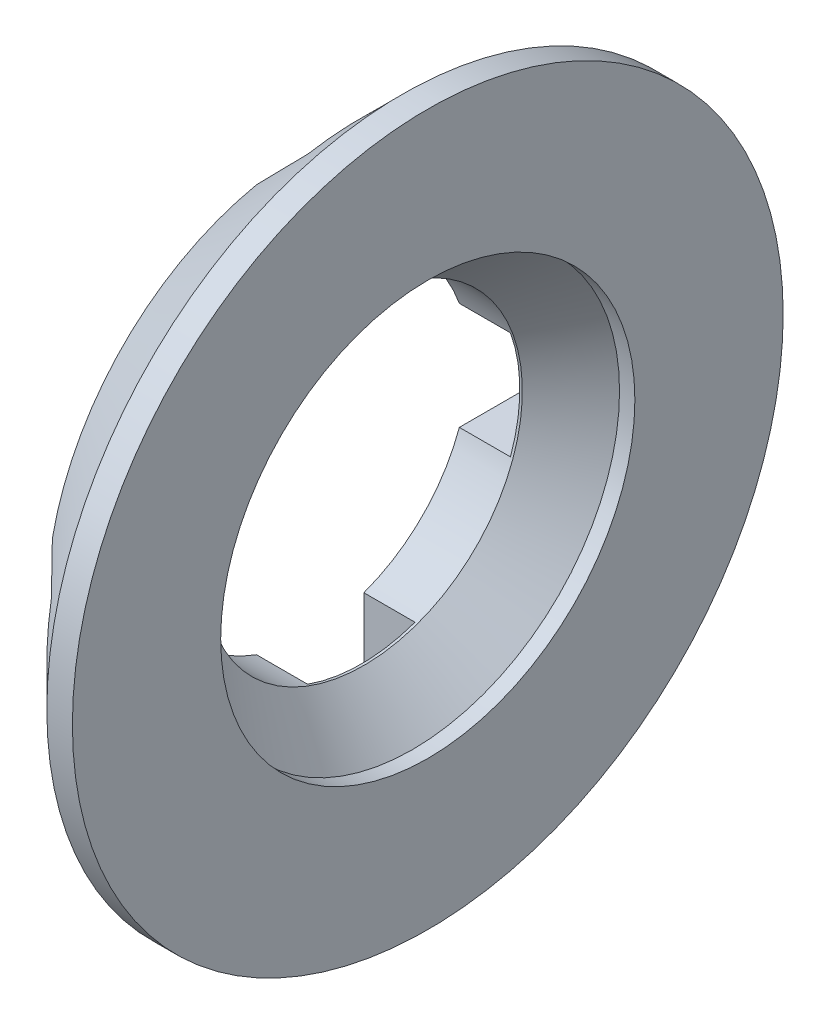
ISO-10303-21;
HEADER;
FILE_DESCRIPTION(('STEP AP214'),'2;1');
FILE_NAME('part.step','',(''),(''),'','','');
FILE_SCHEMA(('AUTOMOTIVE_DESIGN { 1 0 10303 214 1 1 1 1 }'));
ENDSEC;
DATA;
#1=APPLICATION_CONTEXT('core data for automotive mechanical design processes');
#2=APPLICATION_PROTOCOL_DEFINITION('international standard','automotive_design',2000,#1);
#3=PRODUCT_CONTEXT('',#1,'mechanical');
#4=PRODUCT('Part','Part','',(#3));
#5=PRODUCT_RELATED_PRODUCT_CATEGORY('part','',(#4));
#6=PRODUCT_DEFINITION_FORMATION('','',#4);
#7=PRODUCT_DEFINITION_CONTEXT('part definition',#1,'design');
#8=PRODUCT_DEFINITION('design','',#6,#7);
#9=PRODUCT_DEFINITION_SHAPE('','',#8);
#10=(LENGTH_UNIT() NAMED_UNIT(*) SI_UNIT(.MILLI.,.METRE.));
#11=(NAMED_UNIT(*) PLANE_ANGLE_UNIT() SI_UNIT($,.RADIAN.));
#12=(NAMED_UNIT(*) SI_UNIT($,.STERADIAN.) SOLID_ANGLE_UNIT());
#13=UNCERTAINTY_MEASURE_WITH_UNIT(LENGTH_MEASURE(1.E-05),#10,'distance_accuracy_value','');
#14=(GEOMETRIC_REPRESENTATION_CONTEXT(3) GLOBAL_UNCERTAINTY_ASSIGNED_CONTEXT((#13)) GLOBAL_UNIT_ASSIGNED_CONTEXT((#10,
#11,#12)) REPRESENTATION_CONTEXT('',''));
#15=CARTESIAN_POINT('',(0.,0.,0.));
#16=DIRECTION('',(0.,0.,1.));
#17=DIRECTION('',(1.,0.,0.));
#18=AXIS2_PLACEMENT_3D('',#15,#16,#17);
#19=CARTESIAN_POINT('',(8.43297067855262,15.,1.05));
#20=DIRECTION('',(0.,0.,1.));
#21=DIRECTION('',(0.,-1.,0.));
#22=AXIS2_PLACEMENT_3D('',#19,#20,#21);
#23=PLANE('',#22);
#24=CARTESIAN_POINT('',(8.43297067857819,21.0597029630019,1.05));
#25=CARTESIAN_POINT('',(8.2660332643413,20.8903226578739,1.05));
#26=CARTESIAN_POINT('',(8.09923122857827,20.7208093520447,1.05));
#27=CARTESIAN_POINT('',(7.76589789521229,20.3815167198608,1.05));
#28=CARTESIAN_POINT('',(7.59936659763985,20.2117373934761,1.05));
#29=CARTESIAN_POINT('',(7.43297067857179,20.0418250663602,1.05));
#30=B_SPLINE_CURVE_WITH_KNOTS('',3,(#24,#25,#26,#27,#28,#29),.UNSPECIFIED.,.F.,.F.,(4,2,4),(0.,
0.713455758887882,1.4269115982006),.UNSPECIFIED.);
#31=CARTESIAN_POINT('',(8.43297067858806,21.0597029630119,1.05));
#32=VERTEX_POINT('',#31);
#33=CARTESIAN_POINT('',(7.43297067856827,20.0418250663566,1.05));
#34=VERTEX_POINT('',#33);
#35=EDGE_CURVE('E21',#32,#34,#30,.T.);
#36=ORIENTED_EDGE('',*,*,#35,.F.);
#37=DIRECTION('',(0.,1.,0.));
#38=VECTOR('',#37,1.);
#39=CARTESIAN_POINT('',(8.43297067855262,15.,1.05));
#40=LINE('',#39,#38);
#41=CARTESIAN_POINT('',(8.43297067855262,17.916761903207,1.05));
#42=VERTEX_POINT('',#41);
#43=EDGE_CURVE('E176',#42,#32,#40,.T.);
#44=ORIENTED_EDGE('',*,*,#43,.F.);
#45=DIRECTION('',(1.,0.,0.));
#46=VECTOR('',#45,1.);
#47=CARTESIAN_POINT('',(8.43297067855262,17.916761903207,1.05));
#48=LINE('',#47,#46);
#49=CARTESIAN_POINT('',(7.43297067855262,17.916761903207,1.05));
#50=VERTEX_POINT('',#49);
#51=EDGE_CURVE('E274',#50,#42,#48,.T.);
#52=ORIENTED_EDGE('',*,*,#51,.F.);
#53=DIRECTION('',(0.,1.,0.));
#54=VECTOR('',#53,1.);
#55=CARTESIAN_POINT('',(7.43297067855262,15.,1.05));
#56=LINE('',#55,#54);
#57=EDGE_CURVE('E309',#34,#50,#56,.F.);
#58=ORIENTED_EDGE('',*,*,#57,.F.);
#59=EDGE_LOOP('',(#36,#44,#52,#58));
#60=FACE_BOUND('',#59,.T.);
#61=ADVANCED_FACE('F17',(#60),#23,.F.);
#62=CARTESIAN_POINT('',(8.43297067855262,16.05,0.));
#63=DIRECTION('',(0.,1.,0.));
#64=DIRECTION('',(0.,0.,1.));
#65=AXIS2_PLACEMENT_3D('',#62,#63,#64);
#66=PLANE('',#65);
#67=DIRECTION('',(1.,0.,0.));
#68=VECTOR('',#67,1.);
#69=CARTESIAN_POINT('',(8.43297067855262,16.05,2.91676190320705));
#70=LINE('',#69,#68);
#71=CARTESIAN_POINT('',(8.43297067855262,16.05,2.91676190320705));
#72=VERTEX_POINT('',#71);
#73=CARTESIAN_POINT('',(7.43297067855262,16.05,2.91676190320705));
#74=VERTEX_POINT('',#73);
#75=EDGE_CURVE('E228',#72,#74,#70,.F.);
#76=ORIENTED_EDGE('',*,*,#75,.F.);
#77=DIRECTION('',(0.,0.,1.));
#78=VECTOR('',#77,1.);
#79=CARTESIAN_POINT('',(8.43297067855262,16.05,1.05));
#80=LINE('',#79,#78);
#81=CARTESIAN_POINT('',(8.43297067858806,16.05,6.05970296301193));
#82=VERTEX_POINT('',#81);
#83=EDGE_CURVE('E307',#82,#72,#80,.F.);
#84=ORIENTED_EDGE('',*,*,#83,.F.);
#85=CARTESIAN_POINT('',(7.43297067857179,16.05,5.04182506636024));
#86=CARTESIAN_POINT('',(7.59936659763985,16.05,5.21173739347607));
#87=CARTESIAN_POINT('',(7.76589789521229,16.05,5.38151671986084));
#88=CARTESIAN_POINT('',(8.09923122857827,16.05,5.72080935204474));
#89=CARTESIAN_POINT('',(8.2660332643413,16.05,5.89032265787386));
#90=CARTESIAN_POINT('',(8.43297067857819,16.05,6.05970296300191));
#91=B_SPLINE_CURVE_WITH_KNOTS('',3,(#85,#86,#87,#88,#89,#90),.UNSPECIFIED.,.F.,.F.,(4,2,4),(0.,
0.713455839312713,1.4269115982006),.UNSPECIFIED.);
#92=CARTESIAN_POINT('',(7.43297067856827,16.05,5.04182506635664));
#93=VERTEX_POINT('',#92);
#94=EDGE_CURVE('E224',#93,#82,#91,.T.);
#95=ORIENTED_EDGE('',*,*,#94,.F.);
#96=DIRECTION('',(0.,0.,1.));
#97=VECTOR('',#96,1.);
#98=CARTESIAN_POINT('',(7.43297067855262,16.05,0.));
#99=LINE('',#98,#97);
#100=EDGE_CURVE('E175',#74,#93,#99,.T.);
#101=ORIENTED_EDGE('',*,*,#100,.F.);
#102=EDGE_LOOP('',(#76,#84,#95,#101));
#103=FACE_BOUND('',#102,.T.);
#104=ADVANCED_FACE('F229',(#103),#66,.F.);
#105=CARTESIAN_POINT('',(8.43297067855262,15.,1.05));
#106=DIRECTION('',(0.,0.,1.));
#107=DIRECTION('',(0.,-1.,0.));
#108=AXIS2_PLACEMENT_3D('',#105,#106,#107);
#109=PLANE('',#108);
#110=DIRECTION('',(1.,0.,0.));
#111=VECTOR('',#110,1.);
#112=CARTESIAN_POINT('',(8.43297067855262,12.083238096793,1.05000000000002));
#113=LINE('',#112,#111);
#114=CARTESIAN_POINT('',(8.43297067855262,12.083238096793,1.05000000000003));
#115=VERTEX_POINT('',#114);
#116=CARTESIAN_POINT('',(7.43297067855262,12.083238096793,1.05000000000002));
#117=VERTEX_POINT('',#116);
#118=EDGE_CURVE('E269',#115,#117,#113,.F.);
#119=ORIENTED_EDGE('',*,*,#118,.F.);
#120=DIRECTION('',(0.,1.,0.));
#121=VECTOR('',#120,1.);
#122=CARTESIAN_POINT('',(8.43297067855262,15.,1.05000000000004));
#123=LINE('',#122,#121);
#124=CARTESIAN_POINT('',(8.43297067858806,8.94029703698808,1.05000000000004));
#125=VERTEX_POINT('',#124);
#126=EDGE_CURVE('E117',#125,#115,#123,.T.);
#127=ORIENTED_EDGE('',*,*,#126,.F.);
#128=CARTESIAN_POINT('',(7.43297067857179,9.95817493363977,1.05000000000004));
#129=CARTESIAN_POINT('',(7.59936659763985,9.78826260652394,1.05000000000004));
#130=CARTESIAN_POINT('',(7.76589789521229,9.61848328013917,1.05000000000004));
#131=CARTESIAN_POINT('',(8.09923122857827,9.27919064795527,1.05000000000004));
#132=CARTESIAN_POINT('',(8.2660332643413,9.10967734212615,1.05000000000004));
#133=CARTESIAN_POINT('',(8.43297067857819,8.9402970369981,1.05000000000004));
#134=B_SPLINE_CURVE_WITH_KNOTS('',3,(#128,#129,#130,#131,#132,#133),.UNSPECIFIED.,.F.,.F.,(4,2,
4),(0.,0.713455839312713,1.4269115982006),.UNSPECIFIED.);
#135=CARTESIAN_POINT('',(7.43297067856827,9.95817493364336,1.05000000000003));
#136=VERTEX_POINT('',#135);
#137=EDGE_CURVE('E217',#136,#125,#134,.T.);
#138=ORIENTED_EDGE('',*,*,#137,.F.);
#139=DIRECTION('',(0.,1.,0.));
#140=VECTOR('',#139,1.);
#141=CARTESIAN_POINT('',(7.43297067855262,15.,1.05000000000002));
#142=LINE('',#141,#140);
#143=EDGE_CURVE('E302',#117,#136,#142,.F.);
#144=ORIENTED_EDGE('',*,*,#143,.F.);
#145=EDGE_LOOP('',(#119,#127,#138,#144));
#146=FACE_BOUND('',#145,.T.);
#147=ADVANCED_FACE('F232',(#146),#109,.F.);
#148=CARTESIAN_POINT('',(8.43297067855262,13.95,0.));
#149=DIRECTION('',(0.,-1.,0.));
#150=DIRECTION('',(0.,0.,-1.));
#151=AXIS2_PLACEMENT_3D('',#148,#149,#150);
#152=PLANE('',#151);
#153=CARTESIAN_POINT('',(8.43297067857819,13.9500000000001,6.05970296300192));
#154=CARTESIAN_POINT('',(8.2660332643413,13.9500000000001,5.89032265787387));
#155=CARTESIAN_POINT('',(8.09923122857827,13.9500000000001,5.72080935204475));
#156=CARTESIAN_POINT('',(7.76589789521229,13.9500000000001,5.38151671986085));
#157=CARTESIAN_POINT('',(7.59936659763985,13.9500000000001,5.21173739347608));
#158=CARTESIAN_POINT('',(7.43297067857179,13.9500000000001,5.04182506636026));
#159=B_SPLINE_CURVE_WITH_KNOTS('',3,(#153,#154,#155,#156,#157,#158),.UNSPECIFIED.,.F.,.F.,(4,2,
4),(0.,0.713455758887881,1.42691159820059),.UNSPECIFIED.);
#160=CARTESIAN_POINT('',(8.43297067858806,13.95,6.05970296301194));
#161=VERTEX_POINT('',#160);
#162=CARTESIAN_POINT('',(7.43297067856827,13.9500000000001,5.04182506635666));
#163=VERTEX_POINT('',#162);
#164=EDGE_CURVE('E210',#161,#163,#159,.T.);
#165=ORIENTED_EDGE('',*,*,#164,.F.);
#166=DIRECTION('',(0.,0.,1.));
#167=VECTOR('',#166,1.);
#168=CARTESIAN_POINT('',(8.43297067855262,13.95,1.05));
#169=LINE('',#168,#167);
#170=CARTESIAN_POINT('',(8.43297067855262,13.95,2.91676190320706));
#171=VERTEX_POINT('',#170);
#172=EDGE_CURVE('E305',#171,#161,#169,.T.);
#173=ORIENTED_EDGE('',*,*,#172,.F.);
#174=DIRECTION('',(1.,0.,0.));
#175=VECTOR('',#174,1.);
#176=CARTESIAN_POINT('',(8.43297067855262,13.95,2.91676190320706));
#177=LINE('',#176,#175);
#178=CARTESIAN_POINT('',(7.43297067855262,13.95,2.91676190320707));
#179=VERTEX_POINT('',#178);
#180=EDGE_CURVE('E264',#179,#171,#177,.T.);
#181=ORIENTED_EDGE('',*,*,#180,.F.);
#182=DIRECTION('',(0.,0.,1.));
#183=VECTOR('',#182,1.);
#184=CARTESIAN_POINT('',(7.43297067855262,13.9500000000001,0.));
#185=LINE('',#184,#183);
#186=EDGE_CURVE('E299',#163,#179,#185,.F.);
#187=ORIENTED_EDGE('',*,*,#186,.F.);
#188=EDGE_LOOP('',(#165,#173,#181,#187));
#189=FACE_BOUND('',#188,.T.);
#190=ADVANCED_FACE('F236',(#189),#152,.F.);
#191=CARTESIAN_POINT('',(8.43297067855262,15.,-1.05));
#192=DIRECTION('',(0.,0.,-1.));
#193=DIRECTION('',(-1.,0.,0.));
#194=AXIS2_PLACEMENT_3D('',#191,#192,#193);
#195=PLANE('',#194);
#196=CARTESIAN_POINT('',(8.43297067857819,8.94029703699809,-1.05));
#197=CARTESIAN_POINT('',(8.26603326434131,9.10967734212614,-1.05));
#198=CARTESIAN_POINT('',(8.09923122857827,9.27919064795526,-1.05));
#199=CARTESIAN_POINT('',(7.76589789521229,9.61848328013916,-1.05));
#200=CARTESIAN_POINT('',(7.59936659763986,9.78826260652393,-1.05));
#201=CARTESIAN_POINT('',(7.43297067857179,9.95817493363976,-1.05));
#202=B_SPLINE_CURVE_WITH_KNOTS('',3,(#196,#197,#198,#199,#200,#201),.UNSPECIFIED.,.F.,.F.,(4,2,
4),(0.,0.713455758887881,1.4269115982006),.UNSPECIFIED.);
#203=CARTESIAN_POINT('',(8.43297067858806,8.94029703698807,-1.04999999999999));
#204=VERTEX_POINT('',#203);
#205=CARTESIAN_POINT('',(7.43297067856827,9.95817493364335,-1.04999999999998));
#206=VERTEX_POINT('',#205);
#207=EDGE_CURVE('E248',#204,#206,#202,.T.);
#208=ORIENTED_EDGE('',*,*,#207,.F.);
#209=DIRECTION('',(0.,1.,0.));
#210=VECTOR('',#209,1.);
#211=CARTESIAN_POINT('',(8.43297067855262,15.,-1.04999999999998));
#212=LINE('',#211,#210);
#213=CARTESIAN_POINT('',(8.43297067855262,12.0832380967929,-1.04999999999999));
#214=VERTEX_POINT('',#213);
#215=EDGE_CURVE('E179',#214,#204,#212,.F.);
#216=ORIENTED_EDGE('',*,*,#215,.F.);
#217=DIRECTION('',(-1.,0.,0.));
#218=VECTOR('',#217,1.);
#219=CARTESIAN_POINT('',(8.43297067855262,12.0832380967929,-1.05));
#220=LINE('',#219,#218);
#221=CARTESIAN_POINT('',(7.43297067855262,12.0832380967929,-1.04999999999998));
#222=VERTEX_POINT('',#221);
#223=EDGE_CURVE('E252',#222,#214,#220,.F.);
#224=ORIENTED_EDGE('',*,*,#223,.F.);
#225=DIRECTION('',(0.,1.,0.));
#226=VECTOR('',#225,1.);
#227=CARTESIAN_POINT('',(7.43297067855262,15.,-1.04999999999996));
#228=LINE('',#227,#226);
#229=EDGE_CURVE('E293',#206,#222,#228,.T.);
#230=ORIENTED_EDGE('',*,*,#229,.F.);
#231=EDGE_LOOP('',(#208,#216,#224,#230));
#232=FACE_BOUND('',#231,.T.);
#233=ADVANCED_FACE('F241',(#232),#195,.F.);
#234=CARTESIAN_POINT('',(8.43297067855262,13.95,0.));
#235=DIRECTION('',(0.,-1.,0.));
#236=DIRECTION('',(0.,0.,-1.));
#237=AXIS2_PLACEMENT_3D('',#234,#235,#236);
#238=PLANE('',#237);
#239=DIRECTION('',(1.,0.,0.));
#240=VECTOR('',#239,1.);
#241=CARTESIAN_POINT('',(8.43297067855262,13.95,-2.91676190320704));
#242=LINE('',#241,#240);
#243=CARTESIAN_POINT('',(8.43297067855262,13.95,-2.91676190320704));
#244=VERTEX_POINT('',#243);
#245=CARTESIAN_POINT('',(7.43297067855262,13.95,-2.91676190320704));
#246=VERTEX_POINT('',#245);
#247=EDGE_CURVE('E255',#244,#246,#242,.F.);
#248=ORIENTED_EDGE('',*,*,#247,.F.);
#249=DIRECTION('',(0.,0.,1.));
#250=VECTOR('',#249,1.);
#251=CARTESIAN_POINT('',(8.43297067855262,13.95,1.05));
#252=LINE('',#251,#250);
#253=CARTESIAN_POINT('',(8.43297067858806,13.95,-6.05970296301193));
#254=VERTEX_POINT('',#253);
#255=EDGE_CURVE('E128',#254,#244,#252,.T.);
#256=ORIENTED_EDGE('',*,*,#255,.F.);
#257=CARTESIAN_POINT('',(7.43297067857179,13.95,-5.04182506636024));
#258=CARTESIAN_POINT('',(7.59936659763985,13.95,-5.21173739347607));
#259=CARTESIAN_POINT('',(7.76589789521229,13.95,-5.38151671986083));
#260=CARTESIAN_POINT('',(8.09923122857827,13.95,-5.72080935204474));
#261=CARTESIAN_POINT('',(8.2660332643413,13.95,-5.89032265787386));
#262=CARTESIAN_POINT('',(8.43297067857819,13.95,-6.0597029630019));
#263=B_SPLINE_CURVE_WITH_KNOTS('',3,(#257,#258,#259,#260,#261,#262),.UNSPECIFIED.,.F.,.F.,(4,2,
4),(0.,0.713455839312715,1.4269115982006),.UNSPECIFIED.);
#264=CARTESIAN_POINT('',(7.43297067856827,13.95,-5.04182506635664));
#265=VERTEX_POINT('',#264);
#266=EDGE_CURVE('E134',#265,#254,#263,.T.);
#267=ORIENTED_EDGE('',*,*,#266,.F.);
#268=DIRECTION('',(0.,0.,1.));
#269=VECTOR('',#268,1.);
#270=CARTESIAN_POINT('',(7.43297067855262,13.95,0.));
#271=LINE('',#270,#269);
#272=EDGE_CURVE('E296',#246,#265,#271,.F.);
#273=ORIENTED_EDGE('',*,*,#272,.F.);
#274=EDGE_LOOP('',(#248,#256,#267,#273));
#275=FACE_BOUND('',#274,.T.);
#276=ADVANCED_FACE('F245',(#275),#238,.F.);
#277=CARTESIAN_POINT('',(8.43297067855262,15.,-1.05));
#278=DIRECTION('',(0.,0.,-1.));
#279=DIRECTION('',(-1.,0.,0.));
#280=AXIS2_PLACEMENT_3D('',#277,#278,#279);
#281=PLANE('',#280);
#282=DIRECTION('',(-1.,0.,0.));
#283=VECTOR('',#282,1.);
#284=CARTESIAN_POINT('',(8.43297067855262,17.916761903207,-1.05));
#285=LINE('',#284,#283);
#286=CARTESIAN_POINT('',(8.43297067855262,17.916761903207,-1.05));
#287=VERTEX_POINT('',#286);
#288=CARTESIAN_POINT('',(7.43297067855262,17.916761903207,-1.05));
#289=VERTEX_POINT('',#288);
#290=EDGE_CURVE('E323',#287,#289,#285,.T.);
#291=ORIENTED_EDGE('',*,*,#290,.F.);
#292=DIRECTION('',(0.,1.,0.));
#293=VECTOR('',#292,1.);
#294=CARTESIAN_POINT('',(8.43297067855262,15.,-1.05));
#295=LINE('',#294,#293);
#296=CARTESIAN_POINT('',(8.43297067858806,21.0597029630119,-1.05));
#297=VERTEX_POINT('',#296);
#298=EDGE_CURVE('E178',#297,#287,#295,.F.);
#299=ORIENTED_EDGE('',*,*,#298,.F.);
#300=CARTESIAN_POINT('',(7.43297067857179,20.0418250663602,-1.05));
#301=CARTESIAN_POINT('',(7.59936659763985,20.2117373934761,-1.05));
#302=CARTESIAN_POINT('',(7.76589789521229,20.3815167198608,-1.05));
#303=CARTESIAN_POINT('',(8.09923122857827,20.7208093520447,-1.05));
#304=CARTESIAN_POINT('',(8.26603326434131,20.8903226578739,-1.05));
#305=CARTESIAN_POINT('',(8.43297067857819,21.0597029630019,-1.05));
#306=B_SPLINE_CURVE_WITH_KNOTS('',3,(#300,#301,#302,#303,#304,#305),.UNSPECIFIED.,.F.,.F.,(4,2,
4),(0.,0.713455839312717,1.4269115982006),.UNSPECIFIED.);
#307=CARTESIAN_POINT('',(7.43297067856827,20.0418250663566,-1.05));
#308=VERTEX_POINT('',#307);
#309=EDGE_CURVE('E40',#308,#297,#306,.T.);
#310=ORIENTED_EDGE('',*,*,#309,.F.);
#311=DIRECTION('',(0.,1.,0.));
#312=VECTOR('',#311,1.);
#313=CARTESIAN_POINT('',(7.43297067855262,15.,-1.05));
#314=LINE('',#313,#312);
#315=EDGE_CURVE('E127',#289,#308,#314,.T.);
#316=ORIENTED_EDGE('',*,*,#315,.F.);
#317=EDGE_LOOP('',(#291,#299,#310,#316));
#318=FACE_BOUND('',#317,.T.);
#319=ADVANCED_FACE('F382',(#318),#281,.F.);
#320=CARTESIAN_POINT('',(8.43297067855262,16.05,0.));
#321=DIRECTION('',(0.,1.,0.));
#322=DIRECTION('',(0.,0.,1.));
#323=AXIS2_PLACEMENT_3D('',#320,#321,#322);
#324=PLANE('',#323);
#325=CARTESIAN_POINT('',(8.43297067857819,16.05,-6.05970296300191));
#326=CARTESIAN_POINT('',(8.2660332643413,16.05,-5.89032265787387));
#327=CARTESIAN_POINT('',(8.09923122857827,16.05,-5.72080935204474));
#328=CARTESIAN_POINT('',(7.76589789521229,16.05,-5.38151671986084));
#329=CARTESIAN_POINT('',(7.59936659763985,16.05,-5.21173739347607));
#330=CARTESIAN_POINT('',(7.43297067857179,16.05,-5.04182506636025));
#331=B_SPLINE_CURVE_WITH_KNOTS('',3,(#325,#326,#327,#328,#329,#330),.UNSPECIFIED.,.F.,.F.,(4,2,
4),(0.,0.713455758887881,1.4269115982006),.UNSPECIFIED.);
#332=CARTESIAN_POINT('',(8.43297067858806,16.05,-6.05970296301193));
#333=VERTEX_POINT('',#332);
#334=CARTESIAN_POINT('',(7.43297067856827,16.05,-5.04182506635665));
#335=VERTEX_POINT('',#334);
#336=EDGE_CURVE('E104',#333,#335,#331,.T.);
#337=ORIENTED_EDGE('',*,*,#336,.F.);
#338=DIRECTION('',(0.,0.,1.));
#339=VECTOR('',#338,1.);
#340=CARTESIAN_POINT('',(8.43297067855262,16.05,1.05));
#341=LINE('',#340,#339);
#342=CARTESIAN_POINT('',(8.43297067855262,16.05,-2.91676190320705));
#343=VERTEX_POINT('',#342);
#344=EDGE_CURVE('E109',#343,#333,#341,.F.);
#345=ORIENTED_EDGE('',*,*,#344,.F.);
#346=DIRECTION('',(1.,0.,0.));
#347=VECTOR('',#346,1.);
#348=CARTESIAN_POINT('',(8.43297067855262,16.05,-2.91676190320705));
#349=LINE('',#348,#347);
#350=CARTESIAN_POINT('',(7.43297067855262,16.05,-2.91676190320705));
#351=VERTEX_POINT('',#350);
#352=EDGE_CURVE('E118',#351,#343,#349,.T.);
#353=ORIENTED_EDGE('',*,*,#352,.F.);
#354=DIRECTION('',(0.,0.,1.));
#355=VECTOR('',#354,1.);
#356=CARTESIAN_POINT('',(7.43297067855262,16.05,0.));
#357=LINE('',#356,#355);
#358=EDGE_CURVE('E112',#335,#351,#357,.T.);
#359=ORIENTED_EDGE('',*,*,#358,.F.);
#360=EDGE_LOOP('',(#337,#345,#353,#359));
#361=FACE_BOUND('',#360,.T.);
#362=ADVANCED_FACE('F106',(#361),#324,.F.);
#363=CARTESIAN_POINT('',(8.43297067855262,15.,1.05));
#364=DIRECTION('',(-1.,0.,0.));
#365=DIRECTION('',(0.,0.,1.));
#366=AXIS2_PLACEMENT_3D('',#363,#364,#365);
#367=PLANE('',#366);
#368=ORIENTED_EDGE('',*,*,#215,.T.);
#369=CARTESIAN_POINT('',(8.43297067859794,15.,0.));
#370=DIRECTION('',(1.,0.,0.));
#371=DIRECTION('',(0.,0.,-1.));
#372=AXIS2_PLACEMENT_3D('',#369,#370,#371);
#373=CIRCLE('',#372,6.15000000000464);
#374=EDGE_CURVE('E177',#204,#125,#373,.F.);
#375=ORIENTED_EDGE('',*,*,#374,.T.);
#376=ORIENTED_EDGE('',*,*,#126,.T.);
#377=CARTESIAN_POINT('',(8.43297067855262,15.,0.));
#378=DIRECTION('',(1.,0.,0.));
#379=DIRECTION('',(0.,0.,-1.));
#380=AXIS2_PLACEMENT_3D('',#377,#378,#379);
#381=CIRCLE('',#380,3.1);
#382=EDGE_CURVE('E167',#115,#214,#381,.T.);
#383=ORIENTED_EDGE('',*,*,#382,.T.);
#384=EDGE_LOOP('',(#368,#375,#376,#383));
#385=FACE_BOUND('',#384,.T.);
#386=ADVANCED_FACE('F344',(#385),#367,.T.);
#387=CARTESIAN_POINT('',(8.43297067855262,15.,1.05));
#388=DIRECTION('',(-1.,0.,0.));
#389=DIRECTION('',(0.,0.,1.));
#390=AXIS2_PLACEMENT_3D('',#387,#388,#389);
#391=PLANE('',#390);
#392=ORIENTED_EDGE('',*,*,#43,.T.);
#393=CARTESIAN_POINT('',(8.43297067859794,15.,0.));
#394=DIRECTION('',(1.,0.,0.));
#395=DIRECTION('',(0.,0.,-1.));
#396=AXIS2_PLACEMENT_3D('',#393,#394,#395);
#397=CIRCLE('',#396,6.15000000000464);
#398=EDGE_CURVE('E173',#32,#297,#397,.F.);
#399=ORIENTED_EDGE('',*,*,#398,.T.);
#400=ORIENTED_EDGE('',*,*,#298,.T.);
#401=CARTESIAN_POINT('',(8.43297067855262,15.,0.));
#402=DIRECTION('',(1.,0.,0.));
#403=DIRECTION('',(0.,0.,-1.));
#404=AXIS2_PLACEMENT_3D('',#401,#402,#403);
#405=CIRCLE('',#404,3.1);
#406=EDGE_CURVE('E157',#287,#42,#405,.T.);
#407=ORIENTED_EDGE('',*,*,#406,.T.);
#408=EDGE_LOOP('',(#392,#399,#400,#407));
#409=FACE_BOUND('',#408,.T.);
#410=ADVANCED_FACE('F381',(#409),#391,.T.);
#411=CARTESIAN_POINT('',(7.43297067855262,15.,0.));
#412=DIRECTION('',(-1.,0.,0.));
#413=DIRECTION('',(0.,0.,1.));
#414=AXIS2_PLACEMENT_3D('',#411,#412,#413);
#415=PLANE('',#414);
#416=CARTESIAN_POINT('',(7.43297067856474,15.,0.));
#417=DIRECTION('',(1.,0.,0.));
#418=DIRECTION('',(0.,0.,-1.));
#419=AXIS2_PLACEMENT_3D('',#416,#417,#418);
#420=CIRCLE('',#419,5.14999999997144);
#421=EDGE_CURVE('E150',#34,#93,#420,.T.);
#422=ORIENTED_EDGE('',*,*,#421,.F.);
#423=ORIENTED_EDGE('',*,*,#57,.T.);
#424=CARTESIAN_POINT('',(7.43297067855262,15.,0.));
#425=DIRECTION('',(1.,0.,0.));
#426=DIRECTION('',(0.,0.,-1.));
#427=AXIS2_PLACEMENT_3D('',#424,#425,#426);
#428=CIRCLE('',#427,3.1);
#429=EDGE_CURVE('E154',#50,#74,#428,.T.);
#430=ORIENTED_EDGE('',*,*,#429,.T.);
#431=ORIENTED_EDGE('',*,*,#100,.T.);
#432=EDGE_LOOP('',(#422,#423,#430,#431));
#433=FACE_BOUND('',#432,.T.);
#434=ADVANCED_FACE('F372',(#433),#415,.T.);
#435=CARTESIAN_POINT('',(8.43297067855262,15.,1.05));
#436=DIRECTION('',(-1.,0.,0.));
#437=DIRECTION('',(0.,0.,1.));
#438=AXIS2_PLACEMENT_3D('',#435,#436,#437);
#439=PLANE('',#438);
#440=CARTESIAN_POINT('',(8.43297067855262,15.,0.));
#441=DIRECTION('',(1.,0.,0.));
#442=DIRECTION('',(0.,0.,-1.));
#443=AXIS2_PLACEMENT_3D('',#440,#441,#442);
#444=CIRCLE('',#443,3.1);
#445=EDGE_CURVE('E94',#72,#171,#444,.T.);
#446=ORIENTED_EDGE('',*,*,#445,.T.);
#447=ORIENTED_EDGE('',*,*,#172,.T.);
#448=CARTESIAN_POINT('',(8.43297067859794,15.,0.));
#449=DIRECTION('',(1.,0.,0.));
#450=DIRECTION('',(0.,0.,-1.));
#451=AXIS2_PLACEMENT_3D('',#448,#449,#450);
#452=CIRCLE('',#451,6.15000000000464);
#453=EDGE_CURVE('E147',#82,#161,#452,.T.);
#454=ORIENTED_EDGE('',*,*,#453,.F.);
#455=ORIENTED_EDGE('',*,*,#83,.T.);
#456=EDGE_LOOP('',(#446,#447,#454,#455));
#457=FACE_BOUND('',#456,.T.);
#458=ADVANCED_FACE('F375',(#457),#439,.T.);
#459=CARTESIAN_POINT('',(7.43297067855262,15.,0.));
#460=DIRECTION('',(-1.,0.,0.));
#461=DIRECTION('',(0.,0.,1.));
#462=AXIS2_PLACEMENT_3D('',#459,#460,#461);
#463=PLANE('',#462);
#464=CARTESIAN_POINT('',(7.43297067856474,15.,0.));
#465=DIRECTION('',(1.,0.,0.));
#466=DIRECTION('',(0.,0.,-1.));
#467=AXIS2_PLACEMENT_3D('',#464,#465,#466);
#468=CIRCLE('',#467,5.14999999997144);
#469=EDGE_CURVE('E141',#163,#136,#468,.T.);
#470=ORIENTED_EDGE('',*,*,#469,.F.);
#471=ORIENTED_EDGE('',*,*,#186,.T.);
#472=CARTESIAN_POINT('',(7.43297067855262,15.,0.));
#473=DIRECTION('',(1.,0.,0.));
#474=DIRECTION('',(0.,0.,-1.));
#475=AXIS2_PLACEMENT_3D('',#472,#473,#474);
#476=CIRCLE('',#475,3.1);
#477=EDGE_CURVE('E170',#179,#117,#476,.T.);
#478=ORIENTED_EDGE('',*,*,#477,.T.);
#479=ORIENTED_EDGE('',*,*,#143,.T.);
#480=EDGE_LOOP('',(#470,#471,#478,#479));
#481=FACE_BOUND('',#480,.T.);
#482=ADVANCED_FACE('F379',(#481),#463,.T.);
#483=CARTESIAN_POINT('',(7.43297067855262,15.,0.));
#484=DIRECTION('',(-1.,0.,0.));
#485=DIRECTION('',(0.,0.,1.));
#486=AXIS2_PLACEMENT_3D('',#483,#484,#485);
#487=PLANE('',#486);
#488=CARTESIAN_POINT('',(7.43297067856474,15.,0.));
#489=DIRECTION('',(1.,0.,0.));
#490=DIRECTION('',(0.,0.,-1.));
#491=AXIS2_PLACEMENT_3D('',#488,#489,#490);
#492=CIRCLE('',#491,5.14999999997145);
#493=EDGE_CURVE('E137',#206,#265,#492,.T.);
#494=ORIENTED_EDGE('',*,*,#493,.F.);
#495=ORIENTED_EDGE('',*,*,#229,.T.);
#496=CARTESIAN_POINT('',(7.43297067855262,15.,0.));
#497=DIRECTION('',(1.,0.,0.));
#498=DIRECTION('',(0.,0.,-1.));
#499=AXIS2_PLACEMENT_3D('',#496,#497,#498);
#500=CIRCLE('',#499,3.1);
#501=EDGE_CURVE('E164',#222,#246,#500,.T.);
#502=ORIENTED_EDGE('',*,*,#501,.T.);
#503=ORIENTED_EDGE('',*,*,#272,.T.);
#504=EDGE_LOOP('',(#494,#495,#502,#503));
#505=FACE_BOUND('',#504,.T.);
#506=ADVANCED_FACE('F339',(#505),#487,.T.);
#507=CARTESIAN_POINT('',(8.43297067855262,15.,1.05));
#508=DIRECTION('',(-1.,0.,0.));
#509=DIRECTION('',(0.,0.,1.));
#510=AXIS2_PLACEMENT_3D('',#507,#508,#509);
#511=PLANE('',#510);
#512=CARTESIAN_POINT('',(8.43297067855262,15.,0.));
#513=DIRECTION('',(1.,0.,0.));
#514=DIRECTION('',(0.,0.,-1.));
#515=AXIS2_PLACEMENT_3D('',#512,#513,#514);
#516=CIRCLE('',#515,3.1);
#517=EDGE_CURVE('E126',#244,#343,#516,.T.);
#518=ORIENTED_EDGE('',*,*,#517,.T.);
#519=ORIENTED_EDGE('',*,*,#344,.T.);
#520=CARTESIAN_POINT('',(8.43297067859794,15.,0.));
#521=DIRECTION('',(1.,0.,0.));
#522=DIRECTION('',(0.,0.,-1.));
#523=AXIS2_PLACEMENT_3D('',#520,#521,#522);
#524=CIRCLE('',#523,6.15000000000464);
#525=EDGE_CURVE('E124',#254,#333,#524,.T.);
#526=ORIENTED_EDGE('',*,*,#525,.F.);
#527=ORIENTED_EDGE('',*,*,#255,.T.);
#528=EDGE_LOOP('',(#518,#519,#526,#527));
#529=FACE_BOUND('',#528,.T.);
#530=ADVANCED_FACE('F122',(#529),#511,.T.);
#531=CARTESIAN_POINT('',(7.43297067855262,15.,0.));
#532=DIRECTION('',(-1.,0.,0.));
#533=DIRECTION('',(0.,0.,1.));
#534=AXIS2_PLACEMENT_3D('',#531,#532,#533);
#535=PLANE('',#534);
#536=CARTESIAN_POINT('',(7.43297067856474,15.,0.));
#537=DIRECTION('',(1.,0.,0.));
#538=DIRECTION('',(0.,0.,-1.));
#539=AXIS2_PLACEMENT_3D('',#536,#537,#538);
#540=CIRCLE('',#539,5.14999999997144);
#541=EDGE_CURVE('E136',#335,#308,#540,.T.);
#542=ORIENTED_EDGE('',*,*,#541,.F.);
#543=ORIENTED_EDGE('',*,*,#358,.T.);
#544=CARTESIAN_POINT('',(7.43297067855262,15.,0.));
#545=DIRECTION('',(1.,0.,0.));
#546=DIRECTION('',(0.,0.,-1.));
#547=AXIS2_PLACEMENT_3D('',#544,#545,#546);
#548=CIRCLE('',#547,3.1);
#549=EDGE_CURVE('E160',#351,#289,#548,.T.);
#550=ORIENTED_EDGE('',*,*,#549,.T.);
#551=ORIENTED_EDGE('',*,*,#315,.T.);
#552=EDGE_LOOP('',(#542,#543,#550,#551));
#553=FACE_BOUND('',#552,.T.);
#554=ADVANCED_FACE('F384',(#553),#535,.T.);
#555=CARTESIAN_POINT('',(1.73297067855262,15.,0.));
#556=DIRECTION('',(1.,0.,0.));
#557=DIRECTION('',(0.,0.,-1.));
#558=AXIS2_PLACEMENT_3D('',#555,#556,#557);
#559=CYLINDRICAL_SURFACE('',#558,3.1);
#560=CARTESIAN_POINT('',(8.48297067852855,15.,0.));
#561=DIRECTION('',(1.,0.,0.));
#562=DIRECTION('',(0.,0.,1.));
#563=AXIS2_PLACEMENT_3D('',#560,#561,#562);
#564=CIRCLE('',#563,3.10000000007448);
#565=CARTESIAN_POINT('',(8.48297067852855,15.,3.10000000007449));
#566=VERTEX_POINT('',#565);
#567=EDGE_CURVE('E139',#566,#566,#564,.T.);
#568=ORIENTED_EDGE('',*,*,#567,.T.);
#569=EDGE_LOOP('',(#568));
#570=FACE_BOUND('',#569,.T.);
#571=ORIENTED_EDGE('',*,*,#180,.T.);
#572=ORIENTED_EDGE('',*,*,#445,.F.);
#573=ORIENTED_EDGE('',*,*,#75,.T.);
#574=ORIENTED_EDGE('',*,*,#429,.F.);
#575=ORIENTED_EDGE('',*,*,#51,.T.);
#576=ORIENTED_EDGE('',*,*,#406,.F.);
#577=ORIENTED_EDGE('',*,*,#290,.T.);
#578=ORIENTED_EDGE('',*,*,#549,.F.);
#579=ORIENTED_EDGE('',*,*,#352,.T.);
#580=ORIENTED_EDGE('',*,*,#517,.F.);
#581=ORIENTED_EDGE('',*,*,#247,.T.);
#582=ORIENTED_EDGE('',*,*,#501,.F.);
#583=ORIENTED_EDGE('',*,*,#223,.T.);
#584=ORIENTED_EDGE('',*,*,#382,.F.);
#585=ORIENTED_EDGE('',*,*,#118,.T.);
#586=ORIENTED_EDGE('',*,*,#477,.F.);
#587=EDGE_LOOP('',(#571,#572,#573,#574,#575,#576,#577,#578,#579,#580,#581,#582,#583,#584,#585,#586));
#588=FACE_BOUND('',#587,.T.);
#589=ADVANCED_FACE('F197',(#570,#588),#559,.F.);
#590=CARTESIAN_POINT('',(9.2329706786245,15.,0.));
#591=DIRECTION('',(1.,0.,0.));
#592=DIRECTION('',(0.,0.,-1.));
#593=AXIS2_PLACEMENT_3D('',#590,#591,#592);
#594=CONICAL_SURFACE('',#593,6.9500000000312,0.785398163397449);
#595=ORIENTED_EDGE('',*,*,#137,.T.);
#596=ORIENTED_EDGE('',*,*,#374,.F.);
#597=ORIENTED_EDGE('',*,*,#207,.T.);
#598=ORIENTED_EDGE('',*,*,#493,.T.);
#599=ORIENTED_EDGE('',*,*,#266,.T.);
#600=ORIENTED_EDGE('',*,*,#525,.T.);
#601=ORIENTED_EDGE('',*,*,#336,.T.);
#602=ORIENTED_EDGE('',*,*,#541,.T.);
#603=ORIENTED_EDGE('',*,*,#309,.T.);
#604=ORIENTED_EDGE('',*,*,#398,.F.);
#605=ORIENTED_EDGE('',*,*,#35,.T.);
#606=ORIENTED_EDGE('',*,*,#421,.T.);
#607=ORIENTED_EDGE('',*,*,#94,.T.);
#608=ORIENTED_EDGE('',*,*,#453,.T.);
#609=ORIENTED_EDGE('',*,*,#164,.T.);
#610=ORIENTED_EDGE('',*,*,#469,.T.);
#611=EDGE_LOOP('',(#595,#596,#597,#598,#599,#600,#601,#602,#603,#604,#605,#606,#607,#608,#609,#610));
#612=FACE_BOUND('',#611,.T.);
#613=CARTESIAN_POINT('',(9.23297067855262,15.,0.));
#614=DIRECTION('',(1.,0.,0.));
#615=DIRECTION('',(0.,0.,-1.));
#616=AXIS2_PLACEMENT_3D('',#613,#614,#615);
#617=CIRCLE('',#616,6.95);
#618=CARTESIAN_POINT('',(9.23297067855262,15.,-6.95));
#619=VERTEX_POINT('',#618);
#620=EDGE_CURVE('E281',#619,#619,#617,.T.);
#621=ORIENTED_EDGE('',*,*,#620,.F.);
#622=EDGE_LOOP('',(#621));
#623=FACE_BOUND('',#622,.T.);
#624=ADVANCED_FACE('F131',(#612,#623),#594,.T.);
#625=CARTESIAN_POINT('',(9.43297067846061,15.,0.));
#626=DIRECTION('',(1.,0.,0.));
#627=DIRECTION('',(0.,1.,0.));
#628=AXIS2_PLACEMENT_3D('',#625,#626,#627);
#629=CONICAL_SURFACE('',#628,4.05000000000655,0.785398163397448);
#630=ORIENTED_EDGE('',*,*,#567,.F.);
#631=EDGE_LOOP('',(#630));
#632=FACE_BOUND('',#631,.T.);
#633=CARTESIAN_POINT('',(9.43297067855262,15.,0.));
#634=DIRECTION('',(1.,0.,0.));
#635=DIRECTION('',(0.,1.,0.));
#636=AXIS2_PLACEMENT_3D('',#633,#634,#635);
#637=CIRCLE('',#636,4.05);
#638=CARTESIAN_POINT('',(9.43297067855262,19.05,0.));
#639=VERTEX_POINT('',#638);
#640=EDGE_CURVE('E277',#639,#639,#637,.T.);
#641=ORIENTED_EDGE('',*,*,#640,.T.);
#642=EDGE_LOOP('',(#641));
#643=FACE_BOUND('',#642,.T.);
#644=ADVANCED_FACE('F196',(#632,#643),#629,.F.);
#645=CARTESIAN_POINT('',(9.73297067855262,15.,0.));
#646=DIRECTION('',(1.,0.,0.));
#647=DIRECTION('',(0.,0.,-1.));
#648=AXIS2_PLACEMENT_3D('',#645,#646,#647);
#649=CYLINDRICAL_SURFACE('',#648,6.95);
#650=CARTESIAN_POINT('',(9.73297067855262,15.,0.));
#651=DIRECTION('',(1.,0.,0.));
#652=DIRECTION('',(0.,0.,-1.));
#653=AXIS2_PLACEMENT_3D('',#650,#651,#652);
#654=CIRCLE('',#653,6.95);
#655=CARTESIAN_POINT('',(9.73297067855262,15.,-6.95));
#656=VERTEX_POINT('',#655);
#657=EDGE_CURVE('E31',#656,#656,#654,.T.);
#658=ORIENTED_EDGE('',*,*,#657,.F.);
#659=EDGE_LOOP('',(#658));
#660=FACE_BOUND('',#659,.T.);
#661=ORIENTED_EDGE('',*,*,#620,.T.);
#662=EDGE_LOOP('',(#661));
#663=FACE_BOUND('',#662,.T.);
#664=ADVANCED_FACE('F401',(#660,#663),#649,.T.);
#665=CARTESIAN_POINT('',(1.73297067855262,15.,0.));
#666=DIRECTION('',(1.,0.,0.));
#667=DIRECTION('',(0.,1.,0.));
#668=AXIS2_PLACEMENT_3D('',#665,#666,#667);
#669=CYLINDRICAL_SURFACE('',#668,4.05);
#670=CARTESIAN_POINT('',(9.73297067855262,15.,0.));
#671=DIRECTION('',(1.,0.,0.));
#672=DIRECTION('',(0.,1.,0.));
#673=AXIS2_PLACEMENT_3D('',#670,#671,#672);
#674=CIRCLE('',#673,4.05);
#675=CARTESIAN_POINT('',(9.73297067855262,19.05,0.));
#676=VERTEX_POINT('',#675);
#677=EDGE_CURVE('E11',#676,#676,#674,.F.);
#678=ORIENTED_EDGE('',*,*,#677,.F.);
#679=EDGE_LOOP('',(#678));
#680=FACE_BOUND('',#679,.T.);
#681=ORIENTED_EDGE('',*,*,#640,.F.);
#682=EDGE_LOOP('',(#681));
#683=FACE_BOUND('',#682,.T.);
#684=ADVANCED_FACE('F395',(#680,#683),#669,.F.);
#685=CARTESIAN_POINT('',(9.73297067855262,15.,0.));
#686=DIRECTION('',(1.,0.,0.));
#687=DIRECTION('',(0.,0.,-1.));
#688=AXIS2_PLACEMENT_3D('',#685,#686,#687);
#689=PLANE('',#688);
#690=ORIENTED_EDGE('',*,*,#677,.T.);
#691=EDGE_LOOP('',(#690));
#692=FACE_BOUND('',#691,.T.);
#693=ORIENTED_EDGE('',*,*,#657,.T.);
#694=EDGE_LOOP('',(#693));
#695=FACE_BOUND('',#694,.T.);
#696=ADVANCED_FACE('F393',(#692,#695),#689,.T.);
#697=CLOSED_SHELL('',(#61,#104,#147,#190,#233,#276,#319,#362,#386,#410,#434,#458,#482,#506,#530,
#554,#589,#624,#644,#664,#684,#696));
#698=MANIFOLD_SOLID_BREP('B1',#697);
#699=ADVANCED_BREP_SHAPE_REPRESENTATION('',(#18,#698),#14);
#700=SHAPE_DEFINITION_REPRESENTATION(#9,#699);
ENDSEC;
END-ISO-10303-21;
